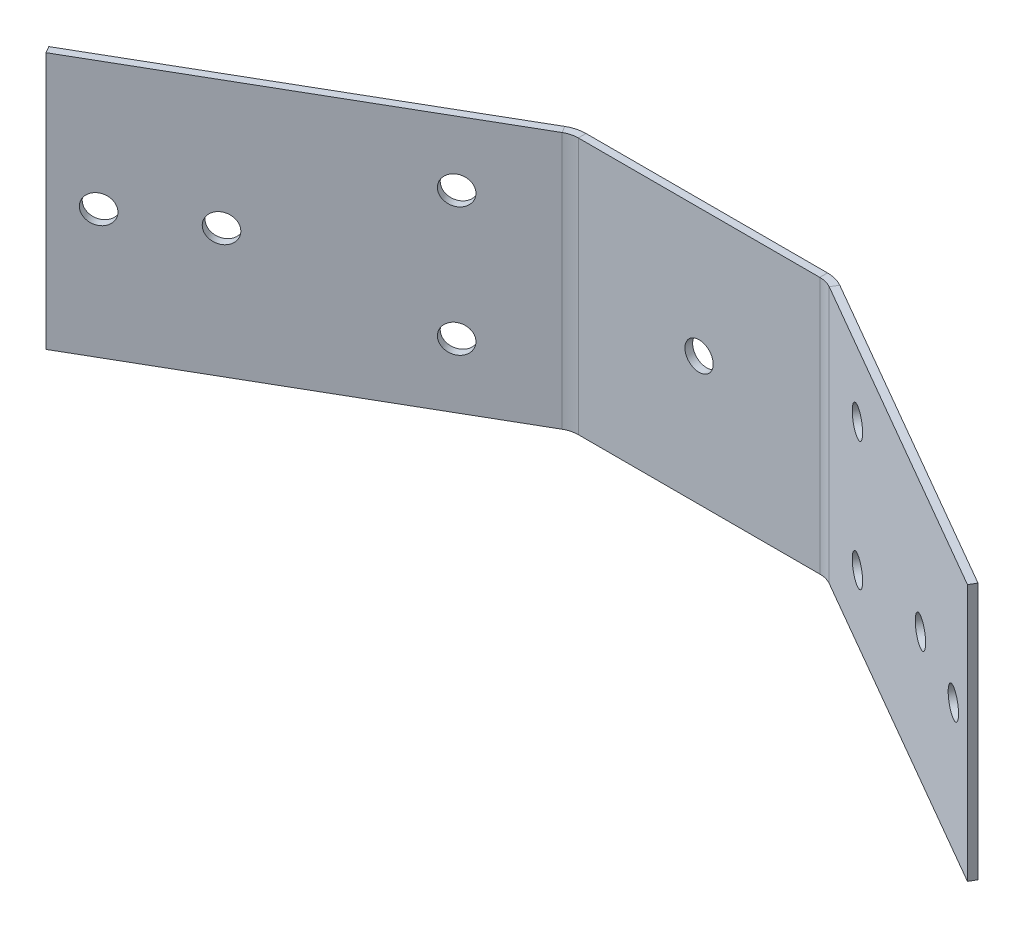
ISO-10303-21;
HEADER;
FILE_DESCRIPTION(('STEP AP214'),'2;1');
FILE_NAME('part.step','',(''),(''),'','','');
FILE_SCHEMA(('AUTOMOTIVE_DESIGN { 1 0 10303 214 1 1 1 1 }'));
ENDSEC;
DATA;
#1=APPLICATION_CONTEXT('core data for automotive mechanical design processes');
#2=APPLICATION_PROTOCOL_DEFINITION('international standard','automotive_design',2000,#1);
#3=PRODUCT_CONTEXT('',#1,'mechanical');
#4=PRODUCT('Part','Part','',(#3));
#5=PRODUCT_RELATED_PRODUCT_CATEGORY('part','',(#4));
#6=PRODUCT_DEFINITION_FORMATION('','',#4);
#7=PRODUCT_DEFINITION_CONTEXT('part definition',#1,'design');
#8=PRODUCT_DEFINITION('design','',#6,#7);
#9=PRODUCT_DEFINITION_SHAPE('','',#8);
#10=(LENGTH_UNIT() NAMED_UNIT(*) SI_UNIT(.MILLI.,.METRE.));
#11=(NAMED_UNIT(*) PLANE_ANGLE_UNIT() SI_UNIT($,.RADIAN.));
#12=(NAMED_UNIT(*) SI_UNIT($,.STERADIAN.) SOLID_ANGLE_UNIT());
#13=UNCERTAINTY_MEASURE_WITH_UNIT(LENGTH_MEASURE(1.E-05),#10,'distance_accuracy_value','');
#14=(GEOMETRIC_REPRESENTATION_CONTEXT(3) GLOBAL_UNCERTAINTY_ASSIGNED_CONTEXT((#13)) GLOBAL_UNIT_ASSIGNED_CONTEXT((#10,
#11,#12)) REPRESENTATION_CONTEXT('',''));
#15=CARTESIAN_POINT('',(0.,0.,0.));
#16=DIRECTION('',(0.,0.,1.));
#17=DIRECTION('',(1.,0.,0.));
#18=AXIS2_PLACEMENT_3D('',#15,#16,#17);
#19=CARTESIAN_POINT('',(0.,100.,3.));
#20=DIRECTION('',(0.,-1.,0.));
#21=DIRECTION('',(-1.,0.,0.));
#22=AXIS2_PLACEMENT_3D('',#19,#20,#21);
#23=PLANE('',#22);
#24=DIRECTION('',(-1.,0.,0.));
#25=VECTOR('',#24,1.);
#26=CARTESIAN_POINT('',(0.,100.,3.));
#27=LINE('',#26,#25);
#28=CARTESIAN_POINT('',(246.98930704031,100.,3.));
#29=VERTEX_POINT('',#28);
#30=CARTESIAN_POINT('',(153.01069295969,100.,3.));
#31=VERTEX_POINT('',#30);
#32=EDGE_CURVE('E245',#29,#31,#27,.T.);
#33=ORIENTED_EDGE('',*,*,#32,.F.);
#34=DIRECTION('',(0.,0.,-1.));
#35=VECTOR('',#34,1.);
#36=CARTESIAN_POINT('',(246.98930704031,100.,3.));
#37=LINE('',#36,#35);
#38=CARTESIAN_POINT('',(246.98930704031,100.,0.));
#39=VERTEX_POINT('',#38);
#40=EDGE_CURVE('E12',#29,#39,#37,.T.);
#41=ORIENTED_EDGE('',*,*,#40,.T.);
#42=DIRECTION('',(-1.,0.,0.));
#43=VECTOR('',#42,1.);
#44=CARTESIAN_POINT('',(0.,100.,0.));
#45=LINE('',#44,#43);
#46=CARTESIAN_POINT('',(153.01069295969,100.,0.));
#47=VERTEX_POINT('',#46);
#48=EDGE_CURVE('E260',#39,#47,#45,.T.);
#49=ORIENTED_EDGE('',*,*,#48,.T.);
#50=DIRECTION('',(0.,0.,-1.));
#51=VECTOR('',#50,1.);
#52=CARTESIAN_POINT('',(153.01069295969,100.,3.));
#53=LINE('',#52,#51);
#54=EDGE_CURVE('E244',#31,#47,#53,.T.);
#55=ORIENTED_EDGE('',*,*,#54,.F.);
#56=EDGE_LOOP('',(#33,#41,#49,#55));
#57=FACE_BOUND('',#56,.T.);
#58=ADVANCED_FACE('F50',(#57),#23,.F.);
#59=CARTESIAN_POINT('',(0.,0.,3.));
#60=DIRECTION('',(0.,1.,0.));
#61=DIRECTION('',(1.,0.,0.));
#62=AXIS2_PLACEMENT_3D('',#59,#60,#61);
#63=PLANE('',#62);
#64=DIRECTION('',(-1.,0.,0.));
#65=VECTOR('',#64,1.);
#66=CARTESIAN_POINT('',(0.,0.,0.));
#67=LINE('',#66,#65);
#68=CARTESIAN_POINT('',(153.01069295969,0.,0.));
#69=VERTEX_POINT('',#68);
#70=CARTESIAN_POINT('',(246.98930704031,0.,0.));
#71=VERTEX_POINT('',#70);
#72=EDGE_CURVE('E74',#69,#71,#67,.F.);
#73=ORIENTED_EDGE('',*,*,#72,.T.);
#74=DIRECTION('',(0.,0.,1.));
#75=VECTOR('',#74,1.);
#76=CARTESIAN_POINT('',(246.98930704031,0.,3.));
#77=LINE('',#76,#75);
#78=CARTESIAN_POINT('',(246.98930704031,0.,3.));
#79=VERTEX_POINT('',#78);
#80=EDGE_CURVE('E256',#71,#79,#77,.T.);
#81=ORIENTED_EDGE('',*,*,#80,.T.);
#82=DIRECTION('',(1.,0.,0.));
#83=VECTOR('',#82,1.);
#84=CARTESIAN_POINT('',(0.,0.,3.));
#85=LINE('',#84,#83);
#86=CARTESIAN_POINT('',(153.01069295969,0.,3.));
#87=VERTEX_POINT('',#86);
#88=EDGE_CURVE('E262',#87,#79,#85,.T.);
#89=ORIENTED_EDGE('',*,*,#88,.F.);
#90=DIRECTION('',(0.,0.,1.));
#91=VECTOR('',#90,1.);
#92=CARTESIAN_POINT('',(153.01069295969,0.,3.));
#93=LINE('',#92,#91);
#94=EDGE_CURVE('E251',#69,#87,#93,.T.);
#95=ORIENTED_EDGE('',*,*,#94,.F.);
#96=EDGE_LOOP('',(#73,#81,#89,#95));
#97=FACE_BOUND('',#96,.T.);
#98=ADVANCED_FACE('F351',(#97),#63,.F.);
#99=CARTESIAN_POINT('',(0.,0.,0.));
#100=DIRECTION('',(0.,0.,-1.));
#101=DIRECTION('',(-1.,0.,0.));
#102=AXIS2_PLACEMENT_3D('',#99,#100,#101);
#103=PLANE('',#102);
#104=CARTESIAN_POINT('',(200.00069295969,49.9999999951981,0.));
#105=DIRECTION('',(0.,0.,1.));
#106=DIRECTION('',(1.,0.,0.));
#107=AXIS2_PLACEMENT_3D('',#104,#105,#106);
#108=CIRCLE('',#107,5.50000000000002);
#109=CARTESIAN_POINT('',(205.50069295969,49.9999999951981,0.));
#110=VERTEX_POINT('',#109);
#111=EDGE_CURVE('E172',#110,#110,#108,.T.);
#112=ORIENTED_EDGE('',*,*,#111,.T.);
#113=EDGE_LOOP('',(#112));
#114=FACE_BOUND('',#113,.T.);
#115=ORIENTED_EDGE('',*,*,#48,.F.);
#116=DIRECTION('',(0.,-1.,0.));
#117=VECTOR('',#116,1.);
#118=CARTESIAN_POINT('',(246.98930704031,0.,0.));
#119=LINE('',#118,#117);
#120=EDGE_CURVE('E58',#39,#71,#119,.T.);
#121=ORIENTED_EDGE('',*,*,#120,.T.);
#122=ORIENTED_EDGE('',*,*,#72,.F.);
#123=DIRECTION('',(0.,-1.,0.));
#124=VECTOR('',#123,1.);
#125=CARTESIAN_POINT('',(153.01069295969,0.,0.));
#126=LINE('',#125,#124);
#127=EDGE_CURVE('E248',#47,#69,#126,.T.);
#128=ORIENTED_EDGE('',*,*,#127,.F.);
#129=EDGE_LOOP('',(#115,#121,#122,#128));
#130=FACE_BOUND('',#129,.T.);
#131=ADVANCED_FACE('F317',(#114,#130),#103,.T.);
#132=CARTESIAN_POINT('',(0.,0.,3.));
#133=DIRECTION('',(0.,0.,-1.));
#134=DIRECTION('',(-1.,0.,0.));
#135=AXIS2_PLACEMENT_3D('',#132,#133,#134);
#136=PLANE('',#135);
#137=CARTESIAN_POINT('',(200.00069295969,49.9999999951981,3.));
#138=DIRECTION('',(0.,0.,-1.));
#139=DIRECTION('',(-1.,0.,0.));
#140=AXIS2_PLACEMENT_3D('',#137,#138,#139);
#141=CIRCLE('',#140,5.50000000000002);
#142=CARTESIAN_POINT('',(194.50069295969,49.9999999951981,3.));
#143=VERTEX_POINT('',#142);
#144=EDGE_CURVE('E189',#143,#143,#141,.F.);
#145=ORIENTED_EDGE('',*,*,#144,.F.);
#146=EDGE_LOOP('',(#145));
#147=FACE_BOUND('',#146,.T.);
#148=DIRECTION('',(0.,-1.,0.));
#149=VECTOR('',#148,1.);
#150=CARTESIAN_POINT('',(246.98930704031,0.,3.));
#151=LINE('',#150,#149);
#152=EDGE_CURVE('E254',#29,#79,#151,.T.);
#153=ORIENTED_EDGE('',*,*,#152,.F.);
#154=ORIENTED_EDGE('',*,*,#32,.T.);
#155=DIRECTION('',(0.,-1.,0.));
#156=VECTOR('',#155,1.);
#157=CARTESIAN_POINT('',(153.01069295969,0.,3.));
#158=LINE('',#157,#156);
#159=EDGE_CURVE('E241',#31,#87,#158,.T.);
#160=ORIENTED_EDGE('',*,*,#159,.T.);
#161=ORIENTED_EDGE('',*,*,#88,.T.);
#162=EDGE_LOOP('',(#153,#154,#160,#161));
#163=FACE_BOUND('',#162,.T.);
#164=ADVANCED_FACE('F326',(#147,#163),#136,.F.);
#165=CARTESIAN_POINT('',(153.01069295969,100.,13.));
#166=DIRECTION('',(0.,-1.,0.));
#167=DIRECTION('',(0.,0.,-1.));
#168=AXIS2_PLACEMENT_3D('',#165,#166,#167);
#169=PLANE('',#168);
#170=ORIENTED_EDGE('',*,*,#54,.T.);
#171=CARTESIAN_POINT('',(153.01069295969,100.,13.));
#172=DIRECTION('',(0.,-1.,0.));
#173=DIRECTION('',(0.,0.,-1.));
#174=AXIS2_PLACEMENT_3D('',#171,#172,#173);
#175=CIRCLE('',#174,13.);
#176=CARTESIAN_POINT('',(146.51069295969,100.,1.74166975080231));
#177=VERTEX_POINT('',#176);
#178=EDGE_CURVE('E201',#47,#177,#175,.F.);
#179=ORIENTED_EDGE('',*,*,#178,.T.);
#180=DIRECTION('',(-0.500000000000001,0.,-0.866025403784438));
#181=VECTOR('',#180,1.);
#182=CARTESIAN_POINT('',(148.01069295969,100.,4.33974596215563));
#183=LINE('',#182,#181);
#184=CARTESIAN_POINT('',(148.01069295969,100.,4.33974596215563));
#185=VERTEX_POINT('',#184);
#186=EDGE_CURVE('E212',#185,#177,#183,.T.);
#187=ORIENTED_EDGE('',*,*,#186,.F.);
#188=CARTESIAN_POINT('',(153.01069295969,100.,13.));
#189=DIRECTION('',(0.,1.,0.));
#190=DIRECTION('',(0.,0.,1.));
#191=AXIS2_PLACEMENT_3D('',#188,#189,#190);
#192=CIRCLE('',#191,10.);
#193=EDGE_CURVE('E230',#31,#185,#192,.T.);
#194=ORIENTED_EDGE('',*,*,#193,.F.);
#195=EDGE_LOOP('',(#170,#179,#187,#194));
#196=FACE_BOUND('',#195,.T.);
#197=ADVANCED_FACE('F329',(#196),#169,.F.);
#198=CARTESIAN_POINT('',(153.01069295969,0.,13.));
#199=DIRECTION('',(0.,1.,0.));
#200=DIRECTION('',(0.,0.,1.));
#201=AXIS2_PLACEMENT_3D('',#198,#199,#200);
#202=PLANE('',#201);
#203=DIRECTION('',(0.500000000000001,0.,0.866025403784438));
#204=VECTOR('',#203,1.);
#205=CARTESIAN_POINT('',(148.01069295969,0.,4.33974596215563));
#206=LINE('',#205,#204);
#207=CARTESIAN_POINT('',(146.51069295969,0.,1.74166975080231));
#208=VERTEX_POINT('',#207);
#209=CARTESIAN_POINT('',(148.01069295969,0.,4.33974596215562));
#210=VERTEX_POINT('',#209);
#211=EDGE_CURVE('E199',#208,#210,#206,.T.);
#212=ORIENTED_EDGE('',*,*,#211,.F.);
#213=CARTESIAN_POINT('',(153.01069295969,0.,13.));
#214=DIRECTION('',(0.,-1.,0.));
#215=DIRECTION('',(0.,0.,-1.));
#216=AXIS2_PLACEMENT_3D('',#213,#214,#215);
#217=CIRCLE('',#216,13.);
#218=EDGE_CURVE('E234',#208,#69,#217,.T.);
#219=ORIENTED_EDGE('',*,*,#218,.T.);
#220=ORIENTED_EDGE('',*,*,#94,.T.);
#221=CARTESIAN_POINT('',(153.01069295969,0.,13.));
#222=DIRECTION('',(0.,-1.,0.));
#223=DIRECTION('',(0.,0.,-1.));
#224=AXIS2_PLACEMENT_3D('',#221,#222,#223);
#225=CIRCLE('',#224,10.);
#226=EDGE_CURVE('E233',#210,#87,#225,.T.);
#227=ORIENTED_EDGE('',*,*,#226,.F.);
#228=EDGE_LOOP('',(#212,#219,#220,#227));
#229=FACE_BOUND('',#228,.T.);
#230=ADVANCED_FACE('F348',(#229),#202,.F.);
#231=CARTESIAN_POINT('',(153.01069295969,150.226029994159,13.));
#232=DIRECTION('',(0.,-1.,0.));
#233=DIRECTION('',(0.,0.,-1.));
#234=AXIS2_PLACEMENT_3D('',#231,#232,#233);
#235=CYLINDRICAL_SURFACE('',#234,10.);
#236=ORIENTED_EDGE('',*,*,#226,.T.);
#237=ORIENTED_EDGE('',*,*,#159,.F.);
#238=ORIENTED_EDGE('',*,*,#193,.T.);
#239=DIRECTION('',(0.,-1.,0.));
#240=VECTOR('',#239,1.);
#241=CARTESIAN_POINT('',(148.01069295969,0.,4.33974596215563));
#242=LINE('',#241,#240);
#243=EDGE_CURVE('E196',#185,#210,#242,.T.);
#244=ORIENTED_EDGE('',*,*,#243,.T.);
#245=EDGE_LOOP('',(#236,#237,#238,#244));
#246=FACE_BOUND('',#245,.T.);
#247=ADVANCED_FACE('F344',(#246),#235,.F.);
#248=CARTESIAN_POINT('',(153.01069295969,150.226029994159,13.));
#249=DIRECTION('',(0.,-1.,0.));
#250=DIRECTION('',(0.,0.,-1.));
#251=AXIS2_PLACEMENT_3D('',#248,#249,#250);
#252=CYLINDRICAL_SURFACE('',#251,13.);
#253=ORIENTED_EDGE('',*,*,#218,.F.);
#254=DIRECTION('',(0.,-1.,0.));
#255=VECTOR('',#254,1.);
#256=CARTESIAN_POINT('',(146.51069295969,0.,1.74166975080231));
#257=LINE('',#256,#255);
#258=EDGE_CURVE('E204',#177,#208,#257,.T.);
#259=ORIENTED_EDGE('',*,*,#258,.F.);
#260=ORIENTED_EDGE('',*,*,#178,.F.);
#261=ORIENTED_EDGE('',*,*,#127,.T.);
#262=EDGE_LOOP('',(#253,#259,#260,#261));
#263=FACE_BOUND('',#262,.T.);
#264=ADVANCED_FACE('F358',(#263),#252,.T.);
#265=CARTESIAN_POINT('',(20.7142189781112,0.,77.8343994823107));
#266=DIRECTION('',(0.866025403784438,0.,-0.500000000000001));
#267=DIRECTION('',(0.,-1.,0.));
#268=AXIS2_PLACEMENT_3D('',#265,#266,#267);
#269=PLANE('',#268);
#270=DIRECTION('',(0.500000000000001,0.,0.866025403784438));
#271=VECTOR('',#270,1.);
#272=CARTESIAN_POINT('',(20.7142189781112,100.,77.8343994823107));
#273=LINE('',#272,#271);
#274=CARTESIAN_POINT('',(19.2142189781112,100.,75.2363232709573));
#275=VERTEX_POINT('',#274);
#276=CARTESIAN_POINT('',(20.7142189781112,100.,77.8343994823107));
#277=VERTEX_POINT('',#276);
#278=EDGE_CURVE('E207',#275,#277,#273,.T.);
#279=ORIENTED_EDGE('',*,*,#278,.F.);
#280=DIRECTION('',(0.,1.,0.));
#281=VECTOR('',#280,1.);
#282=CARTESIAN_POINT('',(19.2142189781112,0.,75.2363232709573));
#283=LINE('',#282,#281);
#284=CARTESIAN_POINT('',(19.2142189781112,0.,75.2363232709573));
#285=VERTEX_POINT('',#284);
#286=EDGE_CURVE('E225',#275,#285,#283,.F.);
#287=ORIENTED_EDGE('',*,*,#286,.T.);
#288=DIRECTION('',(0.500000000000001,0.,0.866025403784438));
#289=VECTOR('',#288,1.);
#290=CARTESIAN_POINT('',(20.7142189781112,0.,77.8343994823107));
#291=LINE('',#290,#289);
#292=CARTESIAN_POINT('',(20.7142189781112,0.,77.8343994823107));
#293=VERTEX_POINT('',#292);
#294=EDGE_CURVE('E223',#285,#293,#291,.T.);
#295=ORIENTED_EDGE('',*,*,#294,.T.);
#296=DIRECTION('',(0.,-1.,0.));
#297=VECTOR('',#296,1.);
#298=CARTESIAN_POINT('',(20.7142189781112,0.,77.8343994823107));
#299=LINE('',#298,#297);
#300=EDGE_CURVE('E218',#277,#293,#299,.T.);
#301=ORIENTED_EDGE('',*,*,#300,.F.);
#302=EDGE_LOOP('',(#279,#287,#295,#301));
#303=FACE_BOUND('',#302,.T.);
#304=ADVANCED_FACE('F373',(#303),#269,.F.);
#305=CARTESIAN_POINT('',(20.7142189781112,0.,77.8343994823107));
#306=DIRECTION('',(-0.500000000000001,0.,-0.866025403784438));
#307=DIRECTION('',(-0.866025403784438,0.,0.500000000000001));
#308=AXIS2_PLACEMENT_3D('',#305,#306,#307);
#309=PLANE('',#308);
#310=CARTESIAN_POINT('',(33.7046000348778,50.,70.3343994823107));
#311=DIRECTION('',(0.500000000000001,0.,0.866025403784438));
#312=DIRECTION('',(0.866025403784438,0.,-0.500000000000001));
#313=AXIS2_PLACEMENT_3D('',#310,#311,#312);
#314=CIRCLE('',#313,5.5);
#315=CARTESIAN_POINT('',(38.4677397556922,50.,67.5843994823107));
#316=VERTEX_POINT('',#315);
#317=EDGE_CURVE('E826',#316,#316,#314,.T.);
#318=ORIENTED_EDGE('',*,*,#317,.F.);
#319=EDGE_LOOP('',(#318));
#320=FACE_BOUND('',#319,.T.);
#321=CARTESIAN_POINT('',(122.029930846157,75.,19.3397459621557));
#322=DIRECTION('',(-0.500000000000001,0.,-0.866025403784438));
#323=DIRECTION('',(-0.866025403784438,0.,0.500000000000001));
#324=AXIS2_PLACEMENT_3D('',#321,#322,#323);
#325=CIRCLE('',#324,5.5);
#326=CARTESIAN_POINT('',(117.266791125343,75.,22.0897459621557));
#327=VERTEX_POINT('',#326);
#328=EDGE_CURVE('E273',#327,#327,#325,.T.);
#329=ORIENTED_EDGE('',*,*,#328,.T.);
#330=EDGE_LOOP('',(#329));
#331=FACE_BOUND('',#330,.T.);
#332=CARTESIAN_POINT('',(122.029930846157,25.,19.3397459621557));
#333=DIRECTION('',(-0.500000000000001,0.,-0.866025403784438));
#334=DIRECTION('',(-0.866025403784438,0.,0.500000000000001));
#335=AXIS2_PLACEMENT_3D('',#332,#333,#334);
#336=CIRCLE('',#335,5.5);
#337=CARTESIAN_POINT('',(117.266791125343,25.,22.0897459621557));
#338=VERTEX_POINT('',#337);
#339=EDGE_CURVE('E292',#338,#338,#336,.T.);
#340=ORIENTED_EDGE('',*,*,#339,.T.);
#341=EDGE_LOOP('',(#340));
#342=FACE_BOUND('',#341,.T.);
#343=CARTESIAN_POINT('',(64.0154891673331,50.,52.8343994823106));
#344=DIRECTION('',(-0.500000000000001,0.,-0.866025403784438));
#345=DIRECTION('',(-0.866025403784438,0.,0.500000000000001));
#346=AXIS2_PLACEMENT_3D('',#343,#344,#345);
#347=CIRCLE('',#346,5.5);
#348=CARTESIAN_POINT('',(59.2523494465187,50.,55.5843994823106));
#349=VERTEX_POINT('',#348);
#350=EDGE_CURVE('E289',#349,#349,#347,.T.);
#351=ORIENTED_EDGE('',*,*,#350,.T.);
#352=EDGE_LOOP('',(#351));
#353=FACE_BOUND('',#352,.T.);
#354=ORIENTED_EDGE('',*,*,#243,.F.);
#355=DIRECTION('',(-0.866025403784438,0.,0.500000000000001));
#356=VECTOR('',#355,1.);
#357=CARTESIAN_POINT('',(20.7142189781112,100.,77.8343994823107));
#358=LINE('',#357,#356);
#359=EDGE_CURVE('E221',#185,#277,#358,.T.);
#360=ORIENTED_EDGE('',*,*,#359,.T.);
#361=ORIENTED_EDGE('',*,*,#300,.T.);
#362=DIRECTION('',(0.866025403784438,0.,-0.500000000000001));
#363=VECTOR('',#362,1.);
#364=CARTESIAN_POINT('',(20.7142189781112,0.,77.8343994823107));
#365=LINE('',#364,#363);
#366=EDGE_CURVE('E215',#293,#210,#365,.T.);
#367=ORIENTED_EDGE('',*,*,#366,.T.);
#368=EDGE_LOOP('',(#354,#360,#361,#367));
#369=FACE_BOUND('',#368,.T.);
#370=ADVANCED_FACE('F368',(#320,#331,#342,#353,#369),#309,.F.);
#371=CARTESIAN_POINT('',(20.7142189781112,100.,77.8343994823107));
#372=DIRECTION('',(0.,-1.,0.));
#373=DIRECTION('',(-0.866025403784438,0.,0.500000000000001));
#374=AXIS2_PLACEMENT_3D('',#371,#372,#373);
#375=PLANE('',#374);
#376=ORIENTED_EDGE('',*,*,#359,.F.);
#377=ORIENTED_EDGE('',*,*,#186,.T.);
#378=DIRECTION('',(-0.866025403784438,0.,0.500000000000001));
#379=VECTOR('',#378,1.);
#380=CARTESIAN_POINT('',(19.2142189781112,100.,75.2363232709573));
#381=LINE('',#380,#379);
#382=EDGE_CURVE('E210',#177,#275,#381,.T.);
#383=ORIENTED_EDGE('',*,*,#382,.T.);
#384=ORIENTED_EDGE('',*,*,#278,.T.);
#385=EDGE_LOOP('',(#376,#377,#383,#384));
#386=FACE_BOUND('',#385,.T.);
#387=ADVANCED_FACE('F375',(#386),#375,.F.);
#388=CARTESIAN_POINT('',(19.2142189781112,0.,75.2363232709573));
#389=DIRECTION('',(-0.500000000000001,0.,-0.866025403784438));
#390=DIRECTION('',(-0.866025403784438,0.,0.500000000000001));
#391=AXIS2_PLACEMENT_3D('',#388,#389,#390);
#392=PLANE('',#391);
#393=CARTESIAN_POINT('',(32.2046000348778,50.,67.7363232709573));
#394=DIRECTION('',(-0.500000000000001,0.,-0.866025403784438));
#395=DIRECTION('',(-0.866025403784438,0.,0.500000000000001));
#396=AXIS2_PLACEMENT_3D('',#393,#394,#395);
#397=CIRCLE('',#396,5.5);
#398=CARTESIAN_POINT('',(27.4414603140634,50.,70.4863232709573));
#399=VERTEX_POINT('',#398);
#400=EDGE_CURVE('E53',#399,#399,#397,.T.);
#401=ORIENTED_EDGE('',*,*,#400,.F.);
#402=EDGE_LOOP('',(#401));
#403=FACE_BOUND('',#402,.T.);
#404=CARTESIAN_POINT('',(120.529930846157,75.,16.7416697508024));
#405=DIRECTION('',(-0.500000000000001,0.,-0.866025403784438));
#406=DIRECTION('',(-0.866025403784438,0.,0.500000000000001));
#407=AXIS2_PLACEMENT_3D('',#404,#405,#406);
#408=CIRCLE('',#407,5.5);
#409=CARTESIAN_POINT('',(115.766791125343,75.,19.4916697508024));
#410=VERTEX_POINT('',#409);
#411=EDGE_CURVE('E293',#410,#410,#408,.T.);
#412=ORIENTED_EDGE('',*,*,#411,.F.);
#413=EDGE_LOOP('',(#412));
#414=FACE_BOUND('',#413,.T.);
#415=CARTESIAN_POINT('',(120.529930846157,25.,16.7416697508024));
#416=DIRECTION('',(-0.500000000000001,0.,-0.866025403784438));
#417=DIRECTION('',(-0.866025403784438,0.,0.500000000000001));
#418=AXIS2_PLACEMENT_3D('',#415,#416,#417);
#419=CIRCLE('',#418,5.5);
#420=CARTESIAN_POINT('',(115.766791125343,25.,19.4916697508024));
#421=VERTEX_POINT('',#420);
#422=EDGE_CURVE('E290',#421,#421,#419,.T.);
#423=ORIENTED_EDGE('',*,*,#422,.F.);
#424=EDGE_LOOP('',(#423));
#425=FACE_BOUND('',#424,.T.);
#426=CARTESIAN_POINT('',(62.5154891673331,50.,50.2363232709573));
#427=DIRECTION('',(-0.500000000000001,0.,-0.866025403784438));
#428=DIRECTION('',(-0.866025403784438,0.,0.500000000000001));
#429=AXIS2_PLACEMENT_3D('',#426,#427,#428);
#430=CIRCLE('',#429,5.5);
#431=CARTESIAN_POINT('',(57.7523494465187,50.,52.9863232709573));
#432=VERTEX_POINT('',#431);
#433=EDGE_CURVE('E286',#432,#432,#430,.T.);
#434=ORIENTED_EDGE('',*,*,#433,.F.);
#435=EDGE_LOOP('',(#434));
#436=FACE_BOUND('',#435,.T.);
#437=ORIENTED_EDGE('',*,*,#382,.F.);
#438=ORIENTED_EDGE('',*,*,#258,.T.);
#439=DIRECTION('',(-0.866025403784438,0.,0.500000000000001));
#440=VECTOR('',#439,1.);
#441=CARTESIAN_POINT('',(19.2142189781112,0.,75.2363232709573));
#442=LINE('',#441,#440);
#443=EDGE_CURVE('E202',#285,#208,#442,.F.);
#444=ORIENTED_EDGE('',*,*,#443,.F.);
#445=ORIENTED_EDGE('',*,*,#286,.F.);
#446=EDGE_LOOP('',(#437,#438,#444,#445));
#447=FACE_BOUND('',#446,.T.);
#448=ADVANCED_FACE('F362',(#403,#414,#425,#436,#447),#392,.T.);
#449=CARTESIAN_POINT('',(20.7142189781112,0.,77.8343994823107));
#450=DIRECTION('',(0.,1.,0.));
#451=DIRECTION('',(0.866025403784438,0.,-0.500000000000001));
#452=AXIS2_PLACEMENT_3D('',#449,#450,#451);
#453=PLANE('',#452);
#454=ORIENTED_EDGE('',*,*,#443,.T.);
#455=ORIENTED_EDGE('',*,*,#211,.T.);
#456=ORIENTED_EDGE('',*,*,#366,.F.);
#457=ORIENTED_EDGE('',*,*,#294,.F.);
#458=EDGE_LOOP('',(#454,#455,#456,#457));
#459=FACE_BOUND('',#458,.T.);
#460=ADVANCED_FACE('F366',(#459),#453,.F.);
#461=CARTESIAN_POINT('',(246.98930704031,100.,13.));
#462=DIRECTION('',(0.,-1.,0.));
#463=DIRECTION('',(0.,0.,-1.));
#464=AXIS2_PLACEMENT_3D('',#461,#462,#463);
#465=PLANE('',#464);
#466=DIRECTION('',(0.500000000000001,0.,-0.866025403784438));
#467=VECTOR('',#466,1.);
#468=CARTESIAN_POINT('',(251.98930704031,100.,4.33974596215563));
#469=LINE('',#468,#467);
#470=CARTESIAN_POINT('',(251.98930704031,100.,4.33974596215563));
#471=VERTEX_POINT('',#470);
#472=CARTESIAN_POINT('',(253.48930704031,100.,1.74166975080232));
#473=VERTEX_POINT('',#472);
#474=EDGE_CURVE('E187',#471,#473,#469,.T.);
#475=ORIENTED_EDGE('',*,*,#474,.T.);
#476=CARTESIAN_POINT('',(246.98930704031,100.,13.));
#477=DIRECTION('',(0.,1.,0.));
#478=DIRECTION('',(0.,0.,1.));
#479=AXIS2_PLACEMENT_3D('',#476,#477,#478);
#480=CIRCLE('',#479,13.);
#481=EDGE_CURVE('E66',#473,#39,#480,.T.);
#482=ORIENTED_EDGE('',*,*,#481,.T.);
#483=ORIENTED_EDGE('',*,*,#40,.F.);
#484=CARTESIAN_POINT('',(246.98930704031,100.,13.));
#485=DIRECTION('',(0.,1.,0.));
#486=DIRECTION('',(0.,0.,1.));
#487=AXIS2_PLACEMENT_3D('',#484,#485,#486);
#488=CIRCLE('',#487,10.);
#489=EDGE_CURVE('E190',#471,#29,#488,.T.);
#490=ORIENTED_EDGE('',*,*,#489,.F.);
#491=EDGE_LOOP('',(#475,#482,#483,#490));
#492=FACE_BOUND('',#491,.T.);
#493=ADVANCED_FACE('F404',(#492),#465,.F.);
#494=CARTESIAN_POINT('',(246.98930704031,0.,13.));
#495=DIRECTION('',(0.,1.,0.));
#496=DIRECTION('',(0.,0.,1.));
#497=AXIS2_PLACEMENT_3D('',#494,#495,#496);
#498=PLANE('',#497);
#499=ORIENTED_EDGE('',*,*,#80,.F.);
#500=CARTESIAN_POINT('',(246.98930704031,0.,13.));
#501=DIRECTION('',(0.,1.,0.));
#502=DIRECTION('',(0.,0.,1.));
#503=AXIS2_PLACEMENT_3D('',#500,#501,#502);
#504=CIRCLE('',#503,13.);
#505=CARTESIAN_POINT('',(253.48930704031,0.,1.74166975080232));
#506=VERTEX_POINT('',#505);
#507=EDGE_CURVE('E167',#71,#506,#504,.F.);
#508=ORIENTED_EDGE('',*,*,#507,.T.);
#509=DIRECTION('',(-0.500000000000001,0.,0.866025403784438));
#510=VECTOR('',#509,1.);
#511=CARTESIAN_POINT('',(251.98930704031,0.,4.33974596215563));
#512=LINE('',#511,#510);
#513=CARTESIAN_POINT('',(251.98930704031,0.,4.3397459621556));
#514=VERTEX_POINT('',#513);
#515=EDGE_CURVE('E161',#506,#514,#512,.T.);
#516=ORIENTED_EDGE('',*,*,#515,.T.);
#517=CARTESIAN_POINT('',(246.98930704031,0.,13.));
#518=DIRECTION('',(0.,-1.,0.));
#519=DIRECTION('',(0.,0.,-1.));
#520=AXIS2_PLACEMENT_3D('',#517,#518,#519);
#521=CIRCLE('',#520,10.);
#522=EDGE_CURVE('E193',#79,#514,#521,.T.);
#523=ORIENTED_EDGE('',*,*,#522,.F.);
#524=EDGE_LOOP('',(#499,#508,#516,#523));
#525=FACE_BOUND('',#524,.T.);
#526=ADVANCED_FACE('F354',(#525),#498,.F.);
#527=CARTESIAN_POINT('',(246.98930704031,-50.2260299941593,13.));
#528=DIRECTION('',(0.,1.,0.));
#529=DIRECTION('',(0.,0.,1.));
#530=AXIS2_PLACEMENT_3D('',#527,#528,#529);
#531=CYLINDRICAL_SURFACE('',#530,10.);
#532=ORIENTED_EDGE('',*,*,#522,.T.);
#533=DIRECTION('',(0.,-1.,0.));
#534=VECTOR('',#533,1.);
#535=CARTESIAN_POINT('',(251.98930704031,0.,4.33974596215563));
#536=LINE('',#535,#534);
#537=EDGE_CURVE('E180',#471,#514,#536,.T.);
#538=ORIENTED_EDGE('',*,*,#537,.F.);
#539=ORIENTED_EDGE('',*,*,#489,.T.);
#540=ORIENTED_EDGE('',*,*,#152,.T.);
#541=EDGE_LOOP('',(#532,#538,#539,#540));
#542=FACE_BOUND('',#541,.T.);
#543=ADVANCED_FACE('F412',(#542),#531,.F.);
#544=CARTESIAN_POINT('',(246.98930704031,-50.2260299941593,13.));
#545=DIRECTION('',(0.,1.,0.));
#546=DIRECTION('',(0.,0.,1.));
#547=AXIS2_PLACEMENT_3D('',#544,#545,#546);
#548=CYLINDRICAL_SURFACE('',#547,13.);
#549=ORIENTED_EDGE('',*,*,#507,.F.);
#550=ORIENTED_EDGE('',*,*,#120,.F.);
#551=ORIENTED_EDGE('',*,*,#481,.F.);
#552=DIRECTION('',(0.,-1.,0.));
#553=VECTOR('',#552,1.);
#554=CARTESIAN_POINT('',(253.48930704031,0.,1.74166975080232));
#555=LINE('',#554,#553);
#556=EDGE_CURVE('E165',#473,#506,#555,.T.);
#557=ORIENTED_EDGE('',*,*,#556,.T.);
#558=EDGE_LOOP('',(#549,#550,#551,#557));
#559=FACE_BOUND('',#558,.T.);
#560=ADVANCED_FACE('F356',(#559),#548,.T.);
#561=CARTESIAN_POINT('',(379.285781021889,0.,77.8343994823107));
#562=DIRECTION('',(-0.866025403784438,0.,-0.500000000000001));
#563=DIRECTION('',(0.,1.,0.));
#564=AXIS2_PLACEMENT_3D('',#561,#562,#563);
#565=PLANE('',#564);
#566=DIRECTION('',(-0.500000000000001,0.,0.866025403784438));
#567=VECTOR('',#566,1.);
#568=CARTESIAN_POINT('',(379.285781021889,0.,77.8343994823107));
#569=LINE('',#568,#567);
#570=CARTESIAN_POINT('',(380.785781021889,0.,75.2363232709574));
#571=VERTEX_POINT('',#570);
#572=CARTESIAN_POINT('',(379.285781021889,0.,77.8343994823107));
#573=VERTEX_POINT('',#572);
#574=EDGE_CURVE('E159',#571,#573,#569,.T.);
#575=ORIENTED_EDGE('',*,*,#574,.F.);
#576=DIRECTION('',(0.,1.,0.));
#577=VECTOR('',#576,1.);
#578=CARTESIAN_POINT('',(380.785781021889,0.,75.2363232709574));
#579=LINE('',#578,#577);
#580=CARTESIAN_POINT('',(380.785781021889,100.,75.2363232709574));
#581=VERTEX_POINT('',#580);
#582=EDGE_CURVE('E153',#571,#581,#579,.T.);
#583=ORIENTED_EDGE('',*,*,#582,.T.);
#584=DIRECTION('',(-0.500000000000001,0.,0.866025403784438));
#585=VECTOR('',#584,1.);
#586=CARTESIAN_POINT('',(379.285781021889,100.,77.8343994823107));
#587=LINE('',#586,#585);
#588=CARTESIAN_POINT('',(379.285781021889,100.,77.8343994823107));
#589=VERTEX_POINT('',#588);
#590=EDGE_CURVE('E142',#581,#589,#587,.T.);
#591=ORIENTED_EDGE('',*,*,#590,.T.);
#592=DIRECTION('',(0.,1.,0.));
#593=VECTOR('',#592,1.);
#594=CARTESIAN_POINT('',(379.285781021889,0.,77.8343994823107));
#595=LINE('',#594,#593);
#596=EDGE_CURVE('E176',#573,#589,#595,.T.);
#597=ORIENTED_EDGE('',*,*,#596,.F.);
#598=EDGE_LOOP('',(#575,#583,#591,#597));
#599=FACE_BOUND('',#598,.T.);
#600=ADVANCED_FACE('F157',(#599),#565,.F.);
#601=CARTESIAN_POINT('',(32.8756195081136,0.,-122.16560051769));
#602=DIRECTION('',(0.500000000000001,0.,-0.866025403784438));
#603=DIRECTION('',(-0.866025403784438,0.,-0.500000000000001));
#604=AXIS2_PLACEMENT_3D('',#601,#602,#603);
#605=PLANE('',#604);
#606=CARTESIAN_POINT('',(277.970069153843,75.,19.3397459621556));
#607=DIRECTION('',(0.500000000000001,0.,-0.866025403784438));
#608=DIRECTION('',(-0.866025403784438,0.,-0.500000000000001));
#609=AXIS2_PLACEMENT_3D('',#606,#607,#608);
#610=CIRCLE('',#609,5.50000000000002);
#611=CARTESIAN_POINT('',(273.206929433028,75.,16.5897459621556));
#612=VERTEX_POINT('',#611);
#613=EDGE_CURVE('E285',#612,#612,#610,.T.);
#614=ORIENTED_EDGE('',*,*,#613,.T.);
#615=EDGE_LOOP('',(#614));
#616=FACE_BOUND('',#615,.T.);
#617=CARTESIAN_POINT('',(366.295399965122,50.,70.3343994823106));
#618=DIRECTION('',(0.500000000000001,0.,-0.866025403784438));
#619=DIRECTION('',(-0.866025403784438,0.,-0.500000000000001));
#620=AXIS2_PLACEMENT_3D('',#617,#618,#619);
#621=CIRCLE('',#620,5.50000000000002);
#622=CARTESIAN_POINT('',(361.532260244308,50.,67.5843994823106));
#623=VERTEX_POINT('',#622);
#624=EDGE_CURVE('E281',#623,#623,#621,.T.);
#625=ORIENTED_EDGE('',*,*,#624,.T.);
#626=EDGE_LOOP('',(#625));
#627=FACE_BOUND('',#626,.T.);
#628=CARTESIAN_POINT('',(335.984510832667,50.,52.8343994823106));
#629=DIRECTION('',(0.500000000000001,0.,-0.866025403784438));
#630=DIRECTION('',(-0.866025403784438,0.,-0.500000000000001));
#631=AXIS2_PLACEMENT_3D('',#628,#629,#630);
#632=CIRCLE('',#631,5.49999999999998);
#633=CARTESIAN_POINT('',(331.221371111853,50.,50.0843994823106));
#634=VERTEX_POINT('',#633);
#635=EDGE_CURVE('E277',#634,#634,#632,.T.);
#636=ORIENTED_EDGE('',*,*,#635,.T.);
#637=EDGE_LOOP('',(#636));
#638=FACE_BOUND('',#637,.T.);
#639=CARTESIAN_POINT('',(277.970069153843,25.,19.3397459621556));
#640=DIRECTION('',(0.500000000000001,0.,-0.866025403784438));
#641=DIRECTION('',(-0.866025403784438,0.,-0.500000000000001));
#642=AXIS2_PLACEMENT_3D('',#639,#640,#641);
#643=CIRCLE('',#642,5.50000000000002);
#644=CARTESIAN_POINT('',(273.206929433028,25.,16.5897459621556));
#645=VERTEX_POINT('',#644);
#646=EDGE_CURVE('E272',#645,#645,#643,.T.);
#647=ORIENTED_EDGE('',*,*,#646,.T.);
#648=EDGE_LOOP('',(#647));
#649=FACE_BOUND('',#648,.T.);
#650=DIRECTION('',(-0.866025403784438,0.,-0.500000000000001));
#651=VECTOR('',#650,1.);
#652=CARTESIAN_POINT('',(32.8756195081136,100.,-122.16560051769));
#653=LINE('',#652,#651);
#654=EDGE_CURVE('E149',#589,#471,#653,.T.);
#655=ORIENTED_EDGE('',*,*,#654,.T.);
#656=ORIENTED_EDGE('',*,*,#537,.T.);
#657=DIRECTION('',(0.866025403784438,0.,0.500000000000001));
#658=VECTOR('',#657,1.);
#659=CARTESIAN_POINT('',(32.8756195081136,0.,-122.16560051769));
#660=LINE('',#659,#658);
#661=EDGE_CURVE('E178',#514,#573,#660,.T.);
#662=ORIENTED_EDGE('',*,*,#661,.T.);
#663=ORIENTED_EDGE('',*,*,#596,.T.);
#664=EDGE_LOOP('',(#655,#656,#662,#663));
#665=FACE_BOUND('',#664,.T.);
#666=ADVANCED_FACE('F531',(#616,#627,#638,#649,#665),#605,.F.);
#667=CARTESIAN_POINT('',(32.8756195081136,0.,-122.16560051769));
#668=DIRECTION('',(0.,1.,0.));
#669=DIRECTION('',(0.866025403784438,0.,0.500000000000001));
#670=AXIS2_PLACEMENT_3D('',#667,#668,#669);
#671=PLANE('',#670);
#672=ORIENTED_EDGE('',*,*,#515,.F.);
#673=DIRECTION('',(-0.866025403784438,0.,-0.500000000000001));
#674=VECTOR('',#673,1.);
#675=CARTESIAN_POINT('',(34.3756195081136,0.,-124.763676729043));
#676=LINE('',#675,#674);
#677=EDGE_CURVE('E169',#506,#571,#676,.F.);
#678=ORIENTED_EDGE('',*,*,#677,.T.);
#679=ORIENTED_EDGE('',*,*,#574,.T.);
#680=ORIENTED_EDGE('',*,*,#661,.F.);
#681=EDGE_LOOP('',(#672,#678,#679,#680));
#682=FACE_BOUND('',#681,.T.);
#683=ADVANCED_FACE('F524',(#682),#671,.F.);
#684=CARTESIAN_POINT('',(34.3756195081136,0.,-124.763676729043));
#685=DIRECTION('',(0.500000000000001,0.,-0.866025403784438));
#686=DIRECTION('',(-0.866025403784438,0.,-0.500000000000001));
#687=AXIS2_PLACEMENT_3D('',#684,#685,#686);
#688=PLANE('',#687);
#689=CARTESIAN_POINT('',(279.470069153843,75.,16.7416697508023));
#690=DIRECTION('',(0.500000000000001,0.,-0.866025403784438));
#691=DIRECTION('',(-0.866025403784438,0.,-0.500000000000001));
#692=AXIS2_PLACEMENT_3D('',#689,#690,#691);
#693=CIRCLE('',#692,5.50000000000002);
#694=CARTESIAN_POINT('',(274.706929433028,75.,13.9916697508023));
#695=VERTEX_POINT('',#694);
#696=EDGE_CURVE('E282',#695,#695,#693,.T.);
#697=ORIENTED_EDGE('',*,*,#696,.F.);
#698=EDGE_LOOP('',(#697));
#699=FACE_BOUND('',#698,.T.);
#700=CARTESIAN_POINT('',(367.795399965122,50.,67.7363232709573));
#701=DIRECTION('',(0.500000000000001,0.,-0.866025403784438));
#702=DIRECTION('',(-0.866025403784438,0.,-0.500000000000001));
#703=AXIS2_PLACEMENT_3D('',#700,#701,#702);
#704=CIRCLE('',#703,5.50000000000002);
#705=CARTESIAN_POINT('',(363.032260244308,50.,64.9863232709573));
#706=VERTEX_POINT('',#705);
#707=EDGE_CURVE('E278',#706,#706,#704,.T.);
#708=ORIENTED_EDGE('',*,*,#707,.F.);
#709=EDGE_LOOP('',(#708));
#710=FACE_BOUND('',#709,.T.);
#711=CARTESIAN_POINT('',(337.484510832667,50.,50.2363232709573));
#712=DIRECTION('',(0.500000000000001,0.,-0.866025403784438));
#713=DIRECTION('',(-0.866025403784438,0.,-0.500000000000001));
#714=AXIS2_PLACEMENT_3D('',#711,#712,#713);
#715=CIRCLE('',#714,5.49999999999998);
#716=CARTESIAN_POINT('',(332.721371111853,50.,47.4863232709573));
#717=VERTEX_POINT('',#716);
#718=EDGE_CURVE('E274',#717,#717,#715,.T.);
#719=ORIENTED_EDGE('',*,*,#718,.F.);
#720=EDGE_LOOP('',(#719));
#721=FACE_BOUND('',#720,.T.);
#722=CARTESIAN_POINT('',(279.470069153843,25.,16.7416697508023));
#723=DIRECTION('',(0.500000000000001,0.,-0.866025403784438));
#724=DIRECTION('',(-0.866025403784438,0.,-0.500000000000001));
#725=AXIS2_PLACEMENT_3D('',#722,#723,#724);
#726=CIRCLE('',#725,5.50000000000002);
#727=CARTESIAN_POINT('',(274.706929433028,25.,13.9916697508023));
#728=VERTEX_POINT('',#727);
#729=EDGE_CURVE('E269',#728,#728,#726,.T.);
#730=ORIENTED_EDGE('',*,*,#729,.F.);
#731=EDGE_LOOP('',(#730));
#732=FACE_BOUND('',#731,.T.);
#733=ORIENTED_EDGE('',*,*,#556,.F.);
#734=DIRECTION('',(-0.866025403784438,0.,-0.500000000000001));
#735=VECTOR('',#734,1.);
#736=CARTESIAN_POINT('',(34.3756195081136,100.,-124.763676729043));
#737=LINE('',#736,#735);
#738=EDGE_CURVE('E147',#581,#473,#737,.T.);
#739=ORIENTED_EDGE('',*,*,#738,.F.);
#740=ORIENTED_EDGE('',*,*,#582,.F.);
#741=ORIENTED_EDGE('',*,*,#677,.F.);
#742=EDGE_LOOP('',(#733,#739,#740,#741));
#743=FACE_BOUND('',#742,.T.);
#744=ADVANCED_FACE('F163',(#699,#710,#721,#732,#743),#688,.T.);
#745=CARTESIAN_POINT('',(32.8756195081136,100.,-122.16560051769));
#746=DIRECTION('',(0.,-1.,0.));
#747=DIRECTION('',(-0.866025403784438,0.,-0.500000000000001));
#748=AXIS2_PLACEMENT_3D('',#745,#746,#747);
#749=PLANE('',#748);
#750=ORIENTED_EDGE('',*,*,#474,.F.);
#751=ORIENTED_EDGE('',*,*,#654,.F.);
#752=ORIENTED_EDGE('',*,*,#590,.F.);
#753=ORIENTED_EDGE('',*,*,#738,.T.);
#754=EDGE_LOOP('',(#750,#751,#752,#753));
#755=FACE_BOUND('',#754,.T.);
#756=ADVANCED_FACE('F145',(#755),#749,.F.);
#757=CARTESIAN_POINT('',(200.00069295969,49.9999999951981,77.8343994823107));
#758=DIRECTION('',(0.,0.,-1.));
#759=DIRECTION('',(-1.,0.,0.));
#760=AXIS2_PLACEMENT_3D('',#757,#758,#759);
#761=CYLINDRICAL_SURFACE('',#760,5.50000000000002);
#762=ORIENTED_EDGE('',*,*,#111,.F.);
#763=EDGE_LOOP('',(#762));
#764=FACE_BOUND('',#763,.T.);
#765=ORIENTED_EDGE('',*,*,#144,.T.);
#766=EDGE_LOOP('',(#765));
#767=FACE_BOUND('',#766,.T.);
#768=ADVANCED_FACE('F319',(#764,#767),#761,.F.);
#769=CARTESIAN_POINT('',(312.048352773837,25.,-39.6855727024156));
#770=DIRECTION('',(-0.500000000000001,0.,0.866025403784438));
#771=DIRECTION('',(0.866025403784438,0.,0.500000000000001));
#772=AXIS2_PLACEMENT_3D('',#769,#770,#771);
#773=CYLINDRICAL_SURFACE('',#772,5.50000000000002);
#774=ORIENTED_EDGE('',*,*,#729,.T.);
#775=EDGE_LOOP('',(#774));
#776=FACE_BOUND('',#775,.T.);
#777=ORIENTED_EDGE('',*,*,#646,.F.);
#778=EDGE_LOOP('',(#777));
#779=FACE_BOUND('',#778,.T.);
#780=ADVANCED_FACE('F322',(#776,#779),#773,.F.);
#781=CARTESIAN_POINT('',(370.062794452661,50.,-6.19091918226066));
#782=DIRECTION('',(-0.500000000000001,0.,0.866025403784438));
#783=DIRECTION('',(0.866025403784438,0.,0.500000000000001));
#784=AXIS2_PLACEMENT_3D('',#781,#782,#783);
#785=CYLINDRICAL_SURFACE('',#784,5.49999999999998);
#786=ORIENTED_EDGE('',*,*,#718,.T.);
#787=EDGE_LOOP('',(#786));
#788=FACE_BOUND('',#787,.T.);
#789=ORIENTED_EDGE('',*,*,#635,.F.);
#790=EDGE_LOOP('',(#789));
#791=FACE_BOUND('',#790,.T.);
#792=ADVANCED_FACE('F488',(#788,#791),#785,.F.);
#793=CARTESIAN_POINT('',(400.373683585116,50.,11.3090808177394));
#794=DIRECTION('',(-0.500000000000001,0.,0.866025403784438));
#795=DIRECTION('',(0.866025403784438,0.,0.500000000000001));
#796=AXIS2_PLACEMENT_3D('',#793,#794,#795);
#797=CYLINDRICAL_SURFACE('',#796,5.50000000000002);
#798=ORIENTED_EDGE('',*,*,#707,.T.);
#799=EDGE_LOOP('',(#798));
#800=FACE_BOUND('',#799,.T.);
#801=ORIENTED_EDGE('',*,*,#624,.F.);
#802=EDGE_LOOP('',(#801));
#803=FACE_BOUND('',#802,.T.);
#804=ADVANCED_FACE('F480',(#800,#803),#797,.F.);
#805=CARTESIAN_POINT('',(312.048352773837,75.,-39.6855727024156));
#806=DIRECTION('',(-0.500000000000001,0.,0.866025403784438));
#807=DIRECTION('',(0.866025403784438,0.,0.500000000000001));
#808=AXIS2_PLACEMENT_3D('',#805,#806,#807);
#809=CYLINDRICAL_SURFACE('',#808,5.50000000000002);
#810=ORIENTED_EDGE('',*,*,#696,.T.);
#811=EDGE_LOOP('',(#810));
#812=FACE_BOUND('',#811,.T.);
#813=ORIENTED_EDGE('',*,*,#613,.F.);
#814=EDGE_LOOP('',(#813));
#815=FACE_BOUND('',#814,.T.);
#816=ADVANCED_FACE('F472',(#812,#815),#809,.F.);
#817=CARTESIAN_POINT('',(29.9372055473394,50.,-6.19091918226063));
#818=DIRECTION('',(0.500000000000001,0.,0.866025403784438));
#819=DIRECTION('',(0.866025403784438,0.,-0.500000000000001));
#820=AXIS2_PLACEMENT_3D('',#817,#818,#819);
#821=CYLINDRICAL_SURFACE('',#820,5.5);
#822=ORIENTED_EDGE('',*,*,#433,.T.);
#823=EDGE_LOOP('',(#822));
#824=FACE_BOUND('',#823,.T.);
#825=ORIENTED_EDGE('',*,*,#350,.F.);
#826=EDGE_LOOP('',(#825));
#827=FACE_BOUND('',#826,.T.);
#828=ADVANCED_FACE('F464',(#824,#827),#821,.F.);
#829=CARTESIAN_POINT('',(87.9516472261633,25.,-39.6855727024155));
#830=DIRECTION('',(0.500000000000001,0.,0.866025403784438));
#831=DIRECTION('',(0.866025403784438,0.,-0.500000000000001));
#832=AXIS2_PLACEMENT_3D('',#829,#830,#831);
#833=CYLINDRICAL_SURFACE('',#832,5.5);
#834=ORIENTED_EDGE('',*,*,#422,.T.);
#835=EDGE_LOOP('',(#834));
#836=FACE_BOUND('',#835,.T.);
#837=ORIENTED_EDGE('',*,*,#339,.F.);
#838=EDGE_LOOP('',(#837));
#839=FACE_BOUND('',#838,.T.);
#840=ADVANCED_FACE('F460',(#836,#839),#833,.F.);
#841=CARTESIAN_POINT('',(87.9516472261633,75.,-39.6855727024155));
#842=DIRECTION('',(0.500000000000001,0.,0.866025403784438));
#843=DIRECTION('',(0.866025403784438,0.,-0.500000000000001));
#844=AXIS2_PLACEMENT_3D('',#841,#842,#843);
#845=CYLINDRICAL_SURFACE('',#844,5.5);
#846=ORIENTED_EDGE('',*,*,#411,.T.);
#847=EDGE_LOOP('',(#846));
#848=FACE_BOUND('',#847,.T.);
#849=ORIENTED_EDGE('',*,*,#328,.F.);
#850=EDGE_LOOP('',(#849));
#851=FACE_BOUND('',#850,.T.);
#852=ADVANCED_FACE('F434',(#848,#851),#845,.F.);
#853=CARTESIAN_POINT('',(28.7046000348778,50.,61.6741454444663));
#854=DIRECTION('',(0.500000000000001,0.,0.866025403784438));
#855=DIRECTION('',(0.866025403784438,0.,-0.500000000000001));
#856=AXIS2_PLACEMENT_3D('',#853,#854,#855);
#857=CYLINDRICAL_SURFACE('',#856,5.5);
#858=ORIENTED_EDGE('',*,*,#400,.T.);
#859=EDGE_LOOP('',(#858));
#860=FACE_BOUND('',#859,.T.);
#861=ORIENTED_EDGE('',*,*,#317,.T.);
#862=EDGE_LOOP('',(#861));
#863=FACE_BOUND('',#862,.T.);
#864=ADVANCED_FACE('F448',(#860,#863),#857,.F.);
#865=CLOSED_SHELL('',(#58,#98,#131,#164,#197,#230,#247,#264,#304,#370,#387,#448,#460,#493,#526,
#543,#560,#600,#666,#683,#744,#756,#768,#780,#792,#804,#816,#828,#840,#852,#864));
#866=MANIFOLD_SOLID_BREP('B2',#865);
#867=ADVANCED_BREP_SHAPE_REPRESENTATION('',(#18,#866),#14);
#868=SHAPE_DEFINITION_REPRESENTATION(#9,#867);
ENDSEC;
END-ISO-10303-21;
